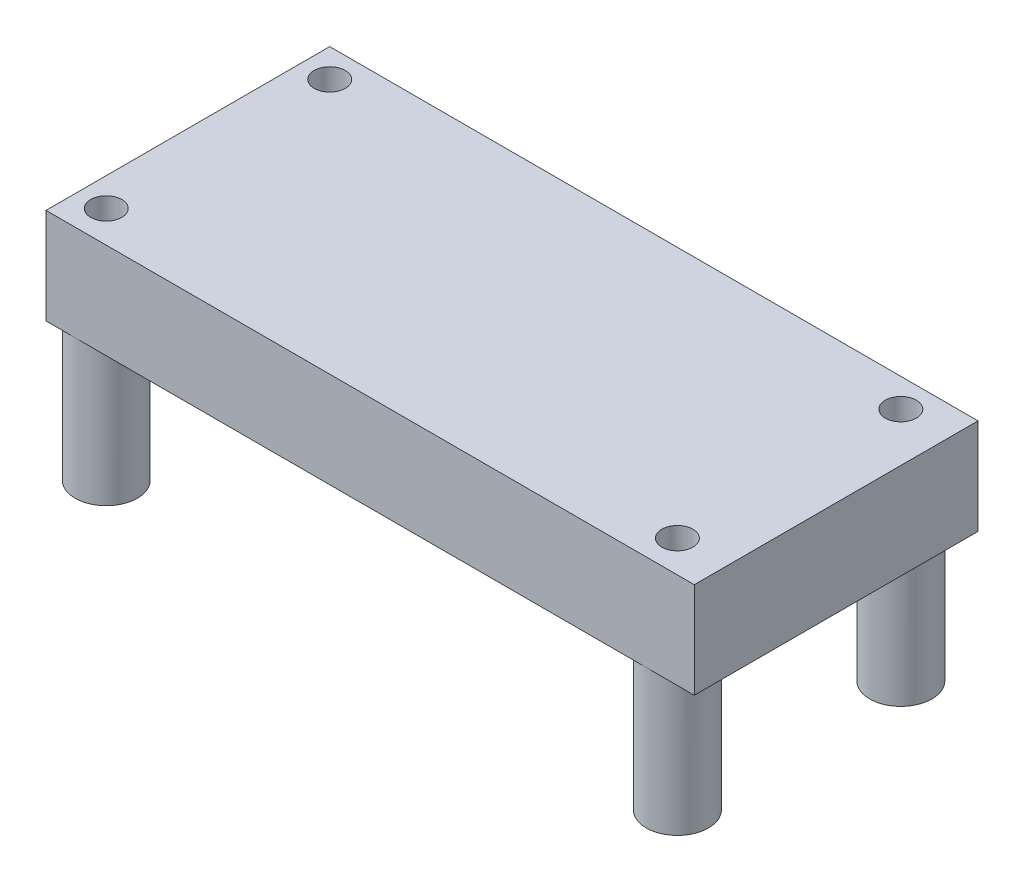
ISO-10303-21;
HEADER;
FILE_DESCRIPTION(('STEP AP214'),'2;1');
FILE_NAME('part.step','',(''),(''),'','','');
FILE_SCHEMA(('AUTOMOTIVE_DESIGN { 1 0 10303 214 1 1 1 1 }'));
ENDSEC;
DATA;
#1=APPLICATION_CONTEXT('core data for automotive mechanical design processes');
#2=APPLICATION_PROTOCOL_DEFINITION('international standard','automotive_design',2000,#1);
#3=PRODUCT_CONTEXT('',#1,'mechanical');
#4=PRODUCT('Part','Part','',(#3));
#5=PRODUCT_RELATED_PRODUCT_CATEGORY('part','',(#4));
#6=PRODUCT_DEFINITION_FORMATION('','',#4);
#7=PRODUCT_DEFINITION_CONTEXT('part definition',#1,'design');
#8=PRODUCT_DEFINITION('design','',#6,#7);
#9=PRODUCT_DEFINITION_SHAPE('','',#8);
#10=(LENGTH_UNIT() NAMED_UNIT(*) SI_UNIT(.MILLI.,.METRE.));
#11=(NAMED_UNIT(*) PLANE_ANGLE_UNIT() SI_UNIT($,.RADIAN.));
#12=(NAMED_UNIT(*) SI_UNIT($,.STERADIAN.) SOLID_ANGLE_UNIT());
#13=UNCERTAINTY_MEASURE_WITH_UNIT(LENGTH_MEASURE(1.E-05),#10,'distance_accuracy_value','');
#14=(GEOMETRIC_REPRESENTATION_CONTEXT(3) GLOBAL_UNCERTAINTY_ASSIGNED_CONTEXT((#13)) GLOBAL_UNIT_ASSIGNED_CONTEXT((#10,
#11,#12)) REPRESENTATION_CONTEXT('',''));
#15=CARTESIAN_POINT('',(0.,0.,0.));
#16=DIRECTION('',(0.,0.,1.));
#17=DIRECTION('',(1.,0.,0.));
#18=AXIS2_PLACEMENT_3D('',#15,#16,#17);
#19=CARTESIAN_POINT('',(0.,0.,0.));
#20=DIRECTION('',(0.,1.,0.));
#21=DIRECTION('',(0.,0.,1.));
#22=AXIS2_PLACEMENT_3D('',#19,#20,#21);
#23=PLANE('',#22);
#24=CARTESIAN_POINT('',(-14.5779448621554,0.,-9.19005739348371));
#25=DIRECTION('',(0.,1.,0.));
#26=DIRECTION('',(0.,0.,1.));
#27=AXIS2_PLACEMENT_3D('',#24,#25,#26);
#28=CIRCLE('',#27,2.5);
#29=CARTESIAN_POINT('',(-16.8639448621554,0.,-10.2020870373183));
#30=VERTEX_POINT('',#29);
#31=CARTESIAN_POINT('',(-15.58997450599,0.,-11.4760573934837));
#32=VERTEX_POINT('',#31);
#33=EDGE_CURVE('E11',#30,#32,#28,.F.);
#34=ORIENTED_EDGE('',*,*,#33,.F.);
#35=DIRECTION('',(0.,0.,1.));
#36=VECTOR('',#35,1.);
#37=CARTESIAN_POINT('',(-16.8639448621554,0.,-11.4760573934837));
#38=LINE('',#37,#36);
#39=CARTESIAN_POINT('',(-16.8639448621554,0.,-11.4760573934837));
#40=VERTEX_POINT('',#39);
#41=EDGE_CURVE('E107',#40,#30,#38,.T.);
#42=ORIENTED_EDGE('',*,*,#41,.F.);
#43=DIRECTION('',(-1.,0.,0.));
#44=VECTOR('',#43,1.);
#45=CARTESIAN_POINT('',(-16.8639448621554,0.,-11.4760573934837));
#46=LINE('',#45,#44);
#47=EDGE_CURVE('E51',#32,#40,#46,.T.);
#48=ORIENTED_EDGE('',*,*,#47,.F.);
#49=EDGE_LOOP('',(#34,#42,#48));
#50=FACE_BOUND('',#49,.T.);
#51=ADVANCED_FACE('F36',(#50),#23,.F.);
#52=CARTESIAN_POINT('',(-16.8639448621554,7.6962,-11.4760573934837));
#53=DIRECTION('',(1.,0.,0.));
#54=DIRECTION('',(0.,0.,-1.));
#55=AXIS2_PLACEMENT_3D('',#52,#53,#54);
#56=PLANE('',#55);
#57=ORIENTED_EDGE('',*,*,#41,.T.);
#58=CARTESIAN_POINT('',(-16.8639448621554,0.,-8.1780277496491));
#59=VERTEX_POINT('',#58);
#60=EDGE_CURVE('E103',#30,#59,#38,.T.);
#61=ORIENTED_EDGE('',*,*,#60,.T.);
#62=CARTESIAN_POINT('',(-16.8639448621554,0.,7.75571296268168));
#63=VERTEX_POINT('',#62);
#64=EDGE_CURVE('E104',#59,#63,#38,.T.);
#65=ORIENTED_EDGE('',*,*,#64,.T.);
#66=CARTESIAN_POINT('',(-16.8639448621554,0.,9.7797722503509));
#67=VERTEX_POINT('',#66);
#68=EDGE_CURVE('E119',#63,#67,#38,.T.);
#69=ORIENTED_EDGE('',*,*,#68,.T.);
#70=CARTESIAN_POINT('',(-16.8639448621554,0.,11.3239426065163));
#71=VERTEX_POINT('',#70);
#72=EDGE_CURVE('E112',#67,#71,#38,.T.);
#73=ORIENTED_EDGE('',*,*,#72,.T.);
#74=DIRECTION('',(0.,-1.,0.));
#75=VECTOR('',#74,1.);
#76=CARTESIAN_POINT('',(-16.8639448621554,7.6962,11.3239426065163));
#77=LINE('',#76,#75);
#78=CARTESIAN_POINT('',(-16.8639448621554,7.6962,11.3239426065163));
#79=VERTEX_POINT('',#78);
#80=EDGE_CURVE('E180',#79,#71,#77,.T.);
#81=ORIENTED_EDGE('',*,*,#80,.F.);
#82=DIRECTION('',(0.,0.,1.));
#83=VECTOR('',#82,1.);
#84=CARTESIAN_POINT('',(-16.8639448621554,7.6962,-11.4760573934837));
#85=LINE('',#84,#83);
#86=CARTESIAN_POINT('',(-16.8639448621554,7.6962,-11.4760573934837));
#87=VERTEX_POINT('',#86);
#88=EDGE_CURVE('E155',#87,#79,#85,.T.);
#89=ORIENTED_EDGE('',*,*,#88,.F.);
#90=DIRECTION('',(0.,-1.,0.));
#91=VECTOR('',#90,1.);
#92=CARTESIAN_POINT('',(-16.8639448621554,7.6962,-11.4760573934837));
#93=LINE('',#92,#91);
#94=EDGE_CURVE('E164',#87,#40,#93,.T.);
#95=ORIENTED_EDGE('',*,*,#94,.T.);
#96=EDGE_LOOP('',(#57,#61,#65,#69,#73,#81,#89,#95));
#97=FACE_BOUND('',#96,.T.);
#98=ADVANCED_FACE('F38',(#97),#56,.F.);
#99=CARTESIAN_POINT('',(-16.8639448621554,7.6962,11.3239426065163));
#100=DIRECTION('',(0.,0.,-1.));
#101=DIRECTION('',(-1.,0.,0.));
#102=AXIS2_PLACEMENT_3D('',#99,#100,#101);
#103=PLANE('',#102);
#104=DIRECTION('',(1.,0.,0.));
#105=VECTOR('',#104,1.);
#106=CARTESIAN_POINT('',(-16.8639448621554,0.,11.3239426065163));
#107=LINE('',#106,#105);
#108=CARTESIAN_POINT('',(35.2360551378446,0.,11.3239426065163));
#109=VERTEX_POINT('',#108);
#110=EDGE_CURVE('E166',#71,#109,#107,.T.);
#111=ORIENTED_EDGE('',*,*,#110,.T.);
#112=DIRECTION('',(0.,-1.,0.));
#113=VECTOR('',#112,1.);
#114=CARTESIAN_POINT('',(35.2360551378446,7.6962,11.3239426065163));
#115=LINE('',#114,#113);
#116=CARTESIAN_POINT('',(35.2360551378446,7.6962,11.3239426065163));
#117=VERTEX_POINT('',#116);
#118=EDGE_CURVE('E177',#117,#109,#115,.T.);
#119=ORIENTED_EDGE('',*,*,#118,.F.);
#120=DIRECTION('',(1.,0.,0.));
#121=VECTOR('',#120,1.);
#122=CARTESIAN_POINT('',(-16.8639448621554,7.6962,11.3239426065163));
#123=LINE('',#122,#121);
#124=EDGE_CURVE('E158',#79,#117,#123,.T.);
#125=ORIENTED_EDGE('',*,*,#124,.F.);
#126=ORIENTED_EDGE('',*,*,#80,.T.);
#127=EDGE_LOOP('',(#111,#119,#125,#126));
#128=FACE_BOUND('',#127,.T.);
#129=ADVANCED_FACE('F197',(#128),#103,.F.);
#130=CARTESIAN_POINT('',(35.2360551378446,7.6962,-11.4760573934837));
#131=DIRECTION('',(-1.,0.,0.));
#132=DIRECTION('',(0.,0.,1.));
#133=AXIS2_PLACEMENT_3D('',#130,#131,#132);
#134=PLANE('',#133);
#135=DIRECTION('',(0.,0.,-1.));
#136=VECTOR('',#135,1.);
#137=CARTESIAN_POINT('',(35.2360551378446,0.,-11.4760573934837));
#138=LINE('',#137,#136);
#139=CARTESIAN_POINT('',(35.2360551378446,0.,-11.4760573934837));
#140=VERTEX_POINT('',#139);
#141=EDGE_CURVE('E168',#109,#140,#138,.T.);
#142=ORIENTED_EDGE('',*,*,#141,.T.);
#143=DIRECTION('',(0.,-1.,0.));
#144=VECTOR('',#143,1.);
#145=CARTESIAN_POINT('',(35.2360551378446,7.6962,-11.4760573934837));
#146=LINE('',#145,#144);
#147=CARTESIAN_POINT('',(35.2360551378446,7.6962,-11.4760573934837));
#148=VERTEX_POINT('',#147);
#149=EDGE_CURVE('E174',#148,#140,#146,.T.);
#150=ORIENTED_EDGE('',*,*,#149,.F.);
#151=DIRECTION('',(0.,0.,-1.));
#152=VECTOR('',#151,1.);
#153=CARTESIAN_POINT('',(35.2360551378446,7.6962,-11.4760573934837));
#154=LINE('',#153,#152);
#155=EDGE_CURVE('E161',#117,#148,#154,.T.);
#156=ORIENTED_EDGE('',*,*,#155,.F.);
#157=ORIENTED_EDGE('',*,*,#118,.T.);
#158=EDGE_LOOP('',(#142,#150,#156,#157));
#159=FACE_BOUND('',#158,.T.);
#160=ADVANCED_FACE('F224',(#159),#134,.F.);
#161=CARTESIAN_POINT('',(-16.8639448621554,7.6962,-11.4760573934837));
#162=DIRECTION('',(0.,0.,1.));
#163=DIRECTION('',(1.,0.,0.));
#164=AXIS2_PLACEMENT_3D('',#161,#162,#163);
#165=PLANE('',#164);
#166=CARTESIAN_POINT('',(32.3318847816792,0.,-11.4760573934837));
#167=VERTEX_POINT('',#166);
#168=EDGE_CURVE('E159',#140,#167,#46,.T.);
#169=ORIENTED_EDGE('',*,*,#168,.T.);
#170=CARTESIAN_POINT('',(30.30782549401,0.,-11.4760573934837));
#171=VERTEX_POINT('',#170);
#172=EDGE_CURVE('E172',#167,#171,#46,.T.);
#173=ORIENTED_EDGE('',*,*,#172,.T.);
#174=CARTESIAN_POINT('',(-13.5659152183208,0.,-11.4760573934837));
#175=VERTEX_POINT('',#174);
#176=EDGE_CURVE('E315',#171,#175,#46,.T.);
#177=ORIENTED_EDGE('',*,*,#176,.T.);
#178=EDGE_CURVE('E318',#175,#32,#46,.T.);
#179=ORIENTED_EDGE('',*,*,#178,.T.);
#180=ORIENTED_EDGE('',*,*,#47,.T.);
#181=ORIENTED_EDGE('',*,*,#94,.F.);
#182=DIRECTION('',(-1.,0.,0.));
#183=VECTOR('',#182,1.);
#184=CARTESIAN_POINT('',(-16.8639448621554,7.6962,-11.4760573934837));
#185=LINE('',#184,#183);
#186=EDGE_CURVE('E163',#148,#87,#185,.T.);
#187=ORIENTED_EDGE('',*,*,#186,.F.);
#188=ORIENTED_EDGE('',*,*,#149,.T.);
#189=EDGE_LOOP('',(#169,#173,#177,#179,#180,#181,#187,#188));
#190=FACE_BOUND('',#189,.T.);
#191=ADVANCED_FACE('F219',(#190),#165,.F.);
#192=CARTESIAN_POINT('',(0.,7.6962,0.));
#193=DIRECTION('',(0.,1.,0.));
#194=DIRECTION('',(0.,0.,1.));
#195=AXIS2_PLACEMENT_3D('',#192,#193,#194);
#196=PLANE('',#195);
#197=CARTESIAN_POINT('',(31.3198551378446,7.6962,8.76774260651629));
#198=DIRECTION('',(0.,-1.,0.));
#199=DIRECTION('',(0.,0.,-1.));
#200=AXIS2_PLACEMENT_3D('',#197,#198,#199);
#201=CIRCLE('',#200,1.25);
#202=CARTESIAN_POINT('',(31.3198551378446,7.6962,7.51774260651629));
#203=VERTEX_POINT('',#202);
#204=EDGE_CURVE('E300',#203,#203,#201,.T.);
#205=ORIENTED_EDGE('',*,*,#204,.T.);
#206=EDGE_LOOP('',(#205));
#207=FACE_BOUND('',#206,.T.);
#208=CARTESIAN_POINT('',(31.3198551378446,7.6962,-9.19005739348371));
#209=DIRECTION('',(0.,-1.,0.));
#210=DIRECTION('',(0.,0.,-1.));
#211=AXIS2_PLACEMENT_3D('',#208,#209,#210);
#212=CIRCLE('',#211,1.25);
#213=CARTESIAN_POINT('',(31.3198551378446,7.6962,-10.4400573934837));
#214=VERTEX_POINT('',#213);
#215=EDGE_CURVE('E294',#214,#214,#212,.T.);
#216=ORIENTED_EDGE('',*,*,#215,.T.);
#217=EDGE_LOOP('',(#216));
#218=FACE_BOUND('',#217,.T.);
#219=CARTESIAN_POINT('',(-14.5779448621554,7.6962,-9.19005739348371));
#220=DIRECTION('',(0.,-1.,0.));
#221=DIRECTION('',(0.,0.,-1.));
#222=AXIS2_PLACEMENT_3D('',#219,#220,#221);
#223=CIRCLE('',#222,1.25);
#224=CARTESIAN_POINT('',(-14.5779448621554,7.6962,-10.4400573934837));
#225=VERTEX_POINT('',#224);
#226=EDGE_CURVE('E283',#225,#225,#223,.T.);
#227=ORIENTED_EDGE('',*,*,#226,.T.);
#228=EDGE_LOOP('',(#227));
#229=FACE_BOUND('',#228,.T.);
#230=CARTESIAN_POINT('',(-14.5779448621554,7.6962,8.76774260651629));
#231=DIRECTION('',(0.,-1.,0.));
#232=DIRECTION('',(0.,0.,-1.));
#233=AXIS2_PLACEMENT_3D('',#230,#231,#232);
#234=CIRCLE('',#233,1.25);
#235=CARTESIAN_POINT('',(-14.5779448621554,7.6962,7.51774260651629));
#236=VERTEX_POINT('',#235);
#237=EDGE_CURVE('E136',#236,#236,#234,.T.);
#238=ORIENTED_EDGE('',*,*,#237,.T.);
#239=EDGE_LOOP('',(#238));
#240=FACE_BOUND('',#239,.T.);
#241=ORIENTED_EDGE('',*,*,#88,.T.);
#242=ORIENTED_EDGE('',*,*,#124,.T.);
#243=ORIENTED_EDGE('',*,*,#155,.T.);
#244=ORIENTED_EDGE('',*,*,#186,.T.);
#245=EDGE_LOOP('',(#241,#242,#243,#244));
#246=FACE_BOUND('',#245,.T.);
#247=ADVANCED_FACE('F200',(#207,#218,#229,#240,#246),#196,.T.);
#248=CARTESIAN_POINT('',(-14.5779448621554,0.,-9.19005739348371));
#249=DIRECTION('',(0.,-1.,0.));
#250=DIRECTION('',(0.,0.,-1.));
#251=AXIS2_PLACEMENT_3D('',#248,#249,#250);
#252=CIRCLE('',#251,2.5);
#253=EDGE_CURVE('E59',#175,#59,#252,.T.);
#254=ORIENTED_EDGE('',*,*,#253,.F.);
#255=ORIENTED_EDGE('',*,*,#176,.F.);
#256=CARTESIAN_POINT('',(31.3198551378446,0.,-9.19005739348371));
#257=DIRECTION('',(0.,-1.,0.));
#258=DIRECTION('',(0.,0.,-1.));
#259=AXIS2_PLACEMENT_3D('',#256,#257,#258);
#260=CIRCLE('',#259,2.5);
#261=EDGE_CURVE('E143',#167,#171,#260,.T.);
#262=ORIENTED_EDGE('',*,*,#261,.F.);
#263=ORIENTED_EDGE('',*,*,#168,.F.);
#264=ORIENTED_EDGE('',*,*,#141,.F.);
#265=ORIENTED_EDGE('',*,*,#110,.F.);
#266=ORIENTED_EDGE('',*,*,#72,.F.);
#267=CARTESIAN_POINT('',(-14.5779448621554,0.,8.76774260651629));
#268=DIRECTION('',(0.,-1.,0.));
#269=DIRECTION('',(0.,0.,-1.));
#270=AXIS2_PLACEMENT_3D('',#267,#268,#269);
#271=CIRCLE('',#270,2.5);
#272=EDGE_CURVE('E117',#63,#67,#271,.T.);
#273=ORIENTED_EDGE('',*,*,#272,.F.);
#274=ORIENTED_EDGE('',*,*,#64,.F.);
#275=EDGE_LOOP('',(#254,#255,#262,#263,#264,#265,#266,#273,#274));
#276=FACE_BOUND('',#275,.T.);
#277=CARTESIAN_POINT('',(31.3198551378446,0.,8.76774260651629));
#278=DIRECTION('',(0.,1.,0.));
#279=DIRECTION('',(0.,0.,1.));
#280=AXIS2_PLACEMENT_3D('',#277,#278,#279);
#281=CIRCLE('',#280,2.5);
#282=CARTESIAN_POINT('',(31.3198551378446,0.,11.2677426065163));
#283=VERTEX_POINT('',#282);
#284=EDGE_CURVE('E44',#283,#283,#281,.F.);
#285=ORIENTED_EDGE('',*,*,#284,.F.);
#286=EDGE_LOOP('',(#285));
#287=FACE_BOUND('',#286,.T.);
#288=ADVANCED_FACE('F113',(#276,#287),#23,.F.);
#289=CARTESIAN_POINT('',(-14.5779448621554,-11.2268,8.76774260651629));
#290=DIRECTION('',(0.,1.,0.));
#291=DIRECTION('',(0.,0.,1.));
#292=AXIS2_PLACEMENT_3D('',#289,#290,#291);
#293=CYLINDRICAL_SURFACE('',#292,2.5);
#294=CARTESIAN_POINT('',(-14.5779448621554,-11.2268,8.76774260651629));
#295=DIRECTION('',(0.,-1.,0.));
#296=DIRECTION('',(0.,0.,-1.));
#297=AXIS2_PLACEMENT_3D('',#294,#295,#296);
#298=CIRCLE('',#297,2.5);
#299=CARTESIAN_POINT('',(-14.5779448621554,-11.2268,6.26774260651629));
#300=VERTEX_POINT('',#299);
#301=EDGE_CURVE('E150',#300,#300,#298,.T.);
#302=ORIENTED_EDGE('',*,*,#301,.F.);
#303=EDGE_LOOP('',(#302));
#304=FACE_BOUND('',#303,.T.);
#305=EDGE_CURVE('E149',#67,#63,#271,.T.);
#306=ORIENTED_EDGE('',*,*,#305,.T.);
#307=ORIENTED_EDGE('',*,*,#272,.T.);
#308=EDGE_LOOP('',(#306,#307));
#309=FACE_BOUND('',#308,.T.);
#310=ADVANCED_FACE('F187',(#304,#309),#293,.T.);
#311=CARTESIAN_POINT('',(-14.5779448621554,-11.2268,8.76774260651629));
#312=DIRECTION('',(0.,-1.,0.));
#313=DIRECTION('',(0.,0.,-1.));
#314=AXIS2_PLACEMENT_3D('',#311,#312,#313);
#315=PLANE('',#314);
#316=CARTESIAN_POINT('',(-14.5779448621554,-11.2268,8.76774260651629));
#317=DIRECTION('',(0.,-1.,0.));
#318=DIRECTION('',(0.,0.,-1.));
#319=AXIS2_PLACEMENT_3D('',#316,#317,#318);
#320=CIRCLE('',#319,1.25);
#321=CARTESIAN_POINT('',(-14.5779448621554,-11.2268,7.51774260651629));
#322=VERTEX_POINT('',#321);
#323=EDGE_CURVE('E140',#322,#322,#320,.T.);
#324=ORIENTED_EDGE('',*,*,#323,.F.);
#325=EDGE_LOOP('',(#324));
#326=FACE_BOUND('',#325,.T.);
#327=ORIENTED_EDGE('',*,*,#301,.T.);
#328=EDGE_LOOP('',(#327));
#329=FACE_BOUND('',#328,.T.);
#330=ADVANCED_FACE('F216',(#326,#329),#315,.T.);
#331=CARTESIAN_POINT('',(-14.5779448621554,0.,8.76774260651629));
#332=DIRECTION('',(0.,-1.,0.));
#333=DIRECTION('',(0.,0.,-1.));
#334=AXIS2_PLACEMENT_3D('',#331,#332,#333);
#335=PLANE('',#334);
#336=ORIENTED_EDGE('',*,*,#68,.F.);
#337=ORIENTED_EDGE('',*,*,#305,.F.);
#338=EDGE_LOOP('',(#336,#337));
#339=FACE_BOUND('',#338,.T.);
#340=ADVANCED_FACE('F189',(#339),#335,.F.);
#341=CARTESIAN_POINT('',(31.3198551378446,-11.2268,8.76774260651629));
#342=DIRECTION('',(0.,1.,0.));
#343=DIRECTION('',(0.,0.,1.));
#344=AXIS2_PLACEMENT_3D('',#341,#342,#343);
#345=CYLINDRICAL_SURFACE('',#344,2.5);
#346=CARTESIAN_POINT('',(31.3198551378446,-11.2268,8.76774260651629));
#347=DIRECTION('',(0.,-1.,0.));
#348=DIRECTION('',(0.,0.,-1.));
#349=AXIS2_PLACEMENT_3D('',#346,#347,#348);
#350=CIRCLE('',#349,2.5);
#351=CARTESIAN_POINT('',(31.3198551378446,-11.2268,6.26774260651629));
#352=VERTEX_POINT('',#351);
#353=EDGE_CURVE('E145',#352,#352,#350,.T.);
#354=ORIENTED_EDGE('',*,*,#353,.F.);
#355=EDGE_LOOP('',(#354));
#356=FACE_BOUND('',#355,.T.);
#357=ORIENTED_EDGE('',*,*,#284,.T.);
#358=EDGE_LOOP('',(#357));
#359=FACE_BOUND('',#358,.T.);
#360=ADVANCED_FACE('F230',(#356,#359),#345,.T.);
#361=CARTESIAN_POINT('',(31.3198551378446,-11.2268,8.76774260651629));
#362=DIRECTION('',(0.,-1.,0.));
#363=DIRECTION('',(0.,0.,-1.));
#364=AXIS2_PLACEMENT_3D('',#361,#362,#363);
#365=PLANE('',#364);
#366=CARTESIAN_POINT('',(31.3198551378446,-11.2268,8.76774260651629));
#367=DIRECTION('',(0.,-1.,0.));
#368=DIRECTION('',(0.,0.,-1.));
#369=AXIS2_PLACEMENT_3D('',#366,#367,#368);
#370=CIRCLE('',#369,1.25);
#371=CARTESIAN_POINT('',(31.3198551378446,-11.2268,7.51774260651629));
#372=VERTEX_POINT('',#371);
#373=EDGE_CURVE('E297',#372,#372,#370,.T.);
#374=ORIENTED_EDGE('',*,*,#373,.F.);
#375=EDGE_LOOP('',(#374));
#376=FACE_BOUND('',#375,.T.);
#377=ORIENTED_EDGE('',*,*,#353,.T.);
#378=EDGE_LOOP('',(#377));
#379=FACE_BOUND('',#378,.T.);
#380=ADVANCED_FACE('F234',(#376,#379),#365,.T.);
#381=CARTESIAN_POINT('',(31.3198551378446,0.,-9.19005739348371));
#382=DIRECTION('',(0.,-1.,0.));
#383=DIRECTION('',(0.,0.,-1.));
#384=AXIS2_PLACEMENT_3D('',#381,#382,#383);
#385=PLANE('',#384);
#386=EDGE_CURVE('E130',#171,#167,#260,.T.);
#387=ORIENTED_EDGE('',*,*,#386,.F.);
#388=ORIENTED_EDGE('',*,*,#172,.F.);
#389=EDGE_LOOP('',(#387,#388));
#390=FACE_BOUND('',#389,.T.);
#391=ADVANCED_FACE('F237',(#390),#385,.F.);
#392=CARTESIAN_POINT('',(31.3198551378446,-11.2268,-9.19005739348371));
#393=DIRECTION('',(0.,1.,0.));
#394=DIRECTION('',(0.,0.,1.));
#395=AXIS2_PLACEMENT_3D('',#392,#393,#394);
#396=CYLINDRICAL_SURFACE('',#395,2.5);
#397=CARTESIAN_POINT('',(31.3198551378446,-11.2268,-9.19005739348371));
#398=DIRECTION('',(0.,-1.,0.));
#399=DIRECTION('',(0.,0.,-1.));
#400=AXIS2_PLACEMENT_3D('',#397,#398,#399);
#401=CIRCLE('',#400,2.5);
#402=CARTESIAN_POINT('',(31.3198551378446,-11.2268,-11.6900573934837));
#403=VERTEX_POINT('',#402);
#404=EDGE_CURVE('E128',#403,#403,#401,.T.);
#405=ORIENTED_EDGE('',*,*,#404,.F.);
#406=EDGE_LOOP('',(#405));
#407=FACE_BOUND('',#406,.T.);
#408=ORIENTED_EDGE('',*,*,#261,.T.);
#409=ORIENTED_EDGE('',*,*,#386,.T.);
#410=EDGE_LOOP('',(#408,#409));
#411=FACE_BOUND('',#410,.T.);
#412=ADVANCED_FACE('F245',(#407,#411),#396,.T.);
#413=CARTESIAN_POINT('',(31.3198551378446,-11.2268,-9.19005739348371));
#414=DIRECTION('',(0.,-1.,0.));
#415=DIRECTION('',(0.,0.,-1.));
#416=AXIS2_PLACEMENT_3D('',#413,#414,#415);
#417=PLANE('',#416);
#418=CARTESIAN_POINT('',(31.3198551378446,-11.2268,-9.19005739348371));
#419=DIRECTION('',(0.,-1.,0.));
#420=DIRECTION('',(0.,0.,-1.));
#421=AXIS2_PLACEMENT_3D('',#418,#419,#420);
#422=CIRCLE('',#421,1.25);
#423=CARTESIAN_POINT('',(31.3198551378446,-11.2268,-10.4400573934837));
#424=VERTEX_POINT('',#423);
#425=EDGE_CURVE('E289',#424,#424,#422,.T.);
#426=ORIENTED_EDGE('',*,*,#425,.F.);
#427=EDGE_LOOP('',(#426));
#428=FACE_BOUND('',#427,.T.);
#429=ORIENTED_EDGE('',*,*,#404,.T.);
#430=EDGE_LOOP('',(#429));
#431=FACE_BOUND('',#430,.T.);
#432=ADVANCED_FACE('F242',(#428,#431),#417,.T.);
#433=CARTESIAN_POINT('',(-14.5779448621554,0.,-9.19005739348371));
#434=DIRECTION('',(0.,-1.,0.));
#435=DIRECTION('',(0.,0.,-1.));
#436=AXIS2_PLACEMENT_3D('',#433,#434,#435);
#437=PLANE('',#436);
#438=EDGE_CURVE('E120',#59,#30,#252,.T.);
#439=ORIENTED_EDGE('',*,*,#438,.F.);
#440=ORIENTED_EDGE('',*,*,#60,.F.);
#441=EDGE_LOOP('',(#439,#440));
#442=FACE_BOUND('',#441,.T.);
#443=ADVANCED_FACE('F121',(#442),#437,.F.);
#444=EDGE_CURVE('E123',#32,#175,#252,.T.);
#445=ORIENTED_EDGE('',*,*,#444,.F.);
#446=ORIENTED_EDGE('',*,*,#178,.F.);
#447=EDGE_LOOP('',(#445,#446));
#448=FACE_BOUND('',#447,.T.);
#449=ADVANCED_FACE('F260',(#448),#437,.F.);
#450=CARTESIAN_POINT('',(-14.5779448621554,-11.2268,-9.19005739348371));
#451=DIRECTION('',(0.,1.,0.));
#452=DIRECTION('',(0.,0.,1.));
#453=AXIS2_PLACEMENT_3D('',#450,#451,#452);
#454=CYLINDRICAL_SURFACE('',#453,2.5);
#455=CARTESIAN_POINT('',(-14.5779448621554,-11.2268,-9.19005739348371));
#456=DIRECTION('',(0.,-1.,0.));
#457=DIRECTION('',(0.,0.,-1.));
#458=AXIS2_PLACEMENT_3D('',#455,#456,#457);
#459=CIRCLE('',#458,2.5);
#460=CARTESIAN_POINT('',(-14.5779448621554,-11.2268,-11.6900573934837));
#461=VERTEX_POINT('',#460);
#462=EDGE_CURVE('E134',#461,#461,#459,.T.);
#463=ORIENTED_EDGE('',*,*,#462,.F.);
#464=EDGE_LOOP('',(#463));
#465=FACE_BOUND('',#464,.T.);
#466=ORIENTED_EDGE('',*,*,#253,.T.);
#467=ORIENTED_EDGE('',*,*,#438,.T.);
#468=ORIENTED_EDGE('',*,*,#33,.T.);
#469=ORIENTED_EDGE('',*,*,#444,.T.);
#470=EDGE_LOOP('',(#466,#467,#468,#469));
#471=FACE_BOUND('',#470,.T.);
#472=ADVANCED_FACE('F126',(#465,#471),#454,.T.);
#473=CARTESIAN_POINT('',(-14.5779448621554,-11.2268,-9.19005739348371));
#474=DIRECTION('',(0.,-1.,0.));
#475=DIRECTION('',(0.,0.,-1.));
#476=AXIS2_PLACEMENT_3D('',#473,#474,#475);
#477=PLANE('',#476);
#478=CARTESIAN_POINT('',(-14.5779448621554,-11.2268,-9.19005739348371));
#479=DIRECTION('',(0.,-1.,0.));
#480=DIRECTION('',(0.,0.,-1.));
#481=AXIS2_PLACEMENT_3D('',#478,#479,#480);
#482=CIRCLE('',#481,1.25);
#483=CARTESIAN_POINT('',(-14.5779448621554,-11.2268,-10.4400573934837));
#484=VERTEX_POINT('',#483);
#485=EDGE_CURVE('E286',#484,#484,#482,.T.);
#486=ORIENTED_EDGE('',*,*,#485,.F.);
#487=EDGE_LOOP('',(#486));
#488=FACE_BOUND('',#487,.T.);
#489=ORIENTED_EDGE('',*,*,#462,.T.);
#490=EDGE_LOOP('',(#489));
#491=FACE_BOUND('',#490,.T.);
#492=ADVANCED_FACE('F253',(#488,#491),#477,.T.);
#493=CARTESIAN_POINT('',(-14.5779448621554,7.6962,-9.19005739348371));
#494=DIRECTION('',(0.,-1.,0.));
#495=DIRECTION('',(0.,0.,-1.));
#496=AXIS2_PLACEMENT_3D('',#493,#494,#495);
#497=CYLINDRICAL_SURFACE('',#496,1.25);
#498=ORIENTED_EDGE('',*,*,#226,.F.);
#499=EDGE_LOOP('',(#498));
#500=FACE_BOUND('',#499,.T.);
#501=ORIENTED_EDGE('',*,*,#485,.T.);
#502=EDGE_LOOP('',(#501));
#503=FACE_BOUND('',#502,.T.);
#504=ADVANCED_FACE('F256',(#500,#503),#497,.F.);
#505=CARTESIAN_POINT('',(31.3198551378446,7.6962,-9.19005739348371));
#506=DIRECTION('',(0.,-1.,0.));
#507=DIRECTION('',(0.,0.,-1.));
#508=AXIS2_PLACEMENT_3D('',#505,#506,#507);
#509=CYLINDRICAL_SURFACE('',#508,1.25);
#510=ORIENTED_EDGE('',*,*,#215,.F.);
#511=EDGE_LOOP('',(#510));
#512=FACE_BOUND('',#511,.T.);
#513=ORIENTED_EDGE('',*,*,#425,.T.);
#514=EDGE_LOOP('',(#513));
#515=FACE_BOUND('',#514,.T.);
#516=ADVANCED_FACE('F271',(#512,#515),#509,.F.);
#517=CARTESIAN_POINT('',(31.3198551378446,7.6962,8.76774260651629));
#518=DIRECTION('',(0.,-1.,0.));
#519=DIRECTION('',(0.,0.,-1.));
#520=AXIS2_PLACEMENT_3D('',#517,#518,#519);
#521=CYLINDRICAL_SURFACE('',#520,1.25);
#522=ORIENTED_EDGE('',*,*,#204,.F.);
#523=EDGE_LOOP('',(#522));
#524=FACE_BOUND('',#523,.T.);
#525=ORIENTED_EDGE('',*,*,#373,.T.);
#526=EDGE_LOOP('',(#525));
#527=FACE_BOUND('',#526,.T.);
#528=ADVANCED_FACE('F267',(#524,#527),#521,.F.);
#529=CARTESIAN_POINT('',(-14.5779448621554,7.6962,8.76774260651629));
#530=DIRECTION('',(0.,-1.,0.));
#531=DIRECTION('',(0.,0.,-1.));
#532=AXIS2_PLACEMENT_3D('',#529,#530,#531);
#533=CYLINDRICAL_SURFACE('',#532,1.25);
#534=ORIENTED_EDGE('',*,*,#237,.F.);
#535=EDGE_LOOP('',(#534));
#536=FACE_BOUND('',#535,.T.);
#537=ORIENTED_EDGE('',*,*,#323,.T.);
#538=EDGE_LOOP('',(#537));
#539=FACE_BOUND('',#538,.T.);
#540=ADVANCED_FACE('F264',(#536,#539),#533,.F.);
#541=CLOSED_SHELL('',(#51,#98,#129,#160,#191,#247,#288,#310,#330,#340,#360,#380,#391,#412,#432,
#443,#449,#472,#492,#504,#516,#528,#540));
#542=MANIFOLD_SOLID_BREP('B2',#541);
#543=ADVANCED_BREP_SHAPE_REPRESENTATION('',(#18,#542),#14);
#544=SHAPE_DEFINITION_REPRESENTATION(#9,#543);
ENDSEC;
END-ISO-10303-21;
